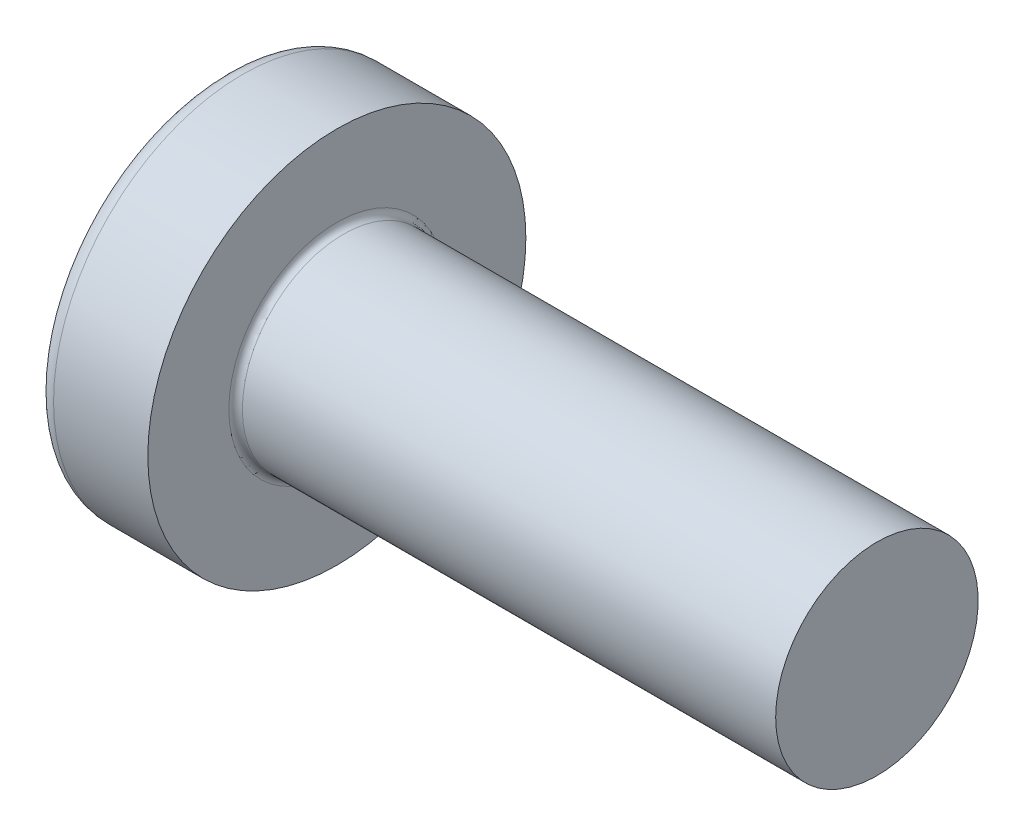
ISO-10303-21;
HEADER;
FILE_DESCRIPTION(('STEP AP214'),'2;1');
FILE_NAME('part.step','',(''),(''),'','','');
FILE_SCHEMA(('AUTOMOTIVE_DESIGN { 1 0 10303 214 1 1 1 1 }'));
ENDSEC;
DATA;
#1=APPLICATION_CONTEXT('core data for automotive mechanical design processes');
#2=APPLICATION_PROTOCOL_DEFINITION('international standard','automotive_design',2000,#1);
#3=PRODUCT_CONTEXT('',#1,'mechanical');
#4=PRODUCT('Part','Part','',(#3));
#5=PRODUCT_RELATED_PRODUCT_CATEGORY('part','',(#4));
#6=PRODUCT_DEFINITION_FORMATION('','',#4);
#7=PRODUCT_DEFINITION_CONTEXT('part definition',#1,'design');
#8=PRODUCT_DEFINITION('design','',#6,#7);
#9=PRODUCT_DEFINITION_SHAPE('','',#8);
#10=(LENGTH_UNIT() NAMED_UNIT(*) SI_UNIT(.MILLI.,.METRE.));
#11=(NAMED_UNIT(*) PLANE_ANGLE_UNIT() SI_UNIT($,.RADIAN.));
#12=(NAMED_UNIT(*) SI_UNIT($,.STERADIAN.) SOLID_ANGLE_UNIT());
#13=UNCERTAINTY_MEASURE_WITH_UNIT(LENGTH_MEASURE(1.E-05),#10,'distance_accuracy_value','');
#14=(GEOMETRIC_REPRESENTATION_CONTEXT(3) GLOBAL_UNCERTAINTY_ASSIGNED_CONTEXT((#13)) GLOBAL_UNIT_ASSIGNED_CONTEXT((#10,
#11,#12)) REPRESENTATION_CONTEXT('',''));
#15=CARTESIAN_POINT('',(0.,0.,0.));
#16=DIRECTION('',(0.,0.,1.));
#17=DIRECTION('',(1.,0.,0.));
#18=AXIS2_PLACEMENT_3D('',#15,#16,#17);
#19=CARTESIAN_POINT('',(5.,0.,0.));
#20=DIRECTION('',(-1.,0.,0.));
#21=DIRECTION('',(0.,1.,0.));
#22=AXIS2_PLACEMENT_3D('',#19,#20,#21);
#23=SPHERICAL_SURFACE('',#22,5.);
#24=CARTESIAN_POINT('',(0.775371598933733,0.,0.));
#25=DIRECTION('',(-1.,0.,0.));
#26=DIRECTION('',(0.,0.,1.));
#27=AXIS2_PLACEMENT_3D('',#24,#25,#26);
#28=CIRCLE('',#27,2.67441860465116);
#29=CARTESIAN_POINT('',(0.775371598933733,0.,2.67441860465116));
#30=VERTEX_POINT('',#29);
#31=EDGE_CURVE('E238',#30,#30,#28,.T.);
#32=ORIENTED_EDGE('',*,*,#31,.T.);
#33=EDGE_LOOP('',(#32));
#34=FACE_BOUND('',#33,.T.);
#35=CARTESIAN_POINT('',(0.0457951200896417,0.,0.));
#36=DIRECTION('',(1.,0.,0.));
#37=DIRECTION('',(0.,0.,-1.));
#38=AXIS2_PLACEMENT_3D('',#35,#36,#37);
#39=CIRCLE('',#38,0.675169614150692);
#40=CARTESIAN_POINT('',(0.0457951200896426,-0.369999999999998,-0.564760133040918));
#41=VERTEX_POINT('',#40);
#42=CARTESIAN_POINT('',(0.0457951200896417,-0.564760133040916,-0.37));
#43=VERTEX_POINT('',#42);
#44=EDGE_CURVE('E376',#41,#43,#39,.F.);
#45=ORIENTED_EDGE('',*,*,#44,.F.);
#46=CARTESIAN_POINT('',(5.,-0.37,0.));
#47=DIRECTION('',(0.,1.,0.));
#48=DIRECTION('',(0.,0.,1.));
#49=AXIS2_PLACEMENT_3D('',#46,#47,#48);
#50=CIRCLE('',#49,4.98629120689917);
#51=CARTESIAN_POINT('',(0.187869731256034,-0.369999999999995,-1.30633161051784));
#52=VERTEX_POINT('',#51);
#53=EDGE_CURVE('E302',#52,#41,#50,.T.);
#54=ORIENTED_EDGE('',*,*,#53,.F.);
#55=CARTESIAN_POINT('',(4.56358245832426,0.,0.875318202045668));
#56=DIRECTION('',(0.446197800778958,0.,-0.89493436774996));
#57=DIRECTION('',(-0.89493436774996,0.,-0.446197800778958));
#58=AXIS2_PLACEMENT_3D('',#55,#56,#57);
#59=CIRCLE('',#58,4.90340267309195);
#60=CARTESIAN_POINT('',(0.187869731256035,0.370000000000005,-1.30633161051784));
#61=VERTEX_POINT('',#60);
#62=EDGE_CURVE('E274',#52,#61,#59,.T.);
#63=ORIENTED_EDGE('',*,*,#62,.T.);
#64=CARTESIAN_POINT('',(5.,0.37,0.));
#65=DIRECTION('',(0.,-1.,0.));
#66=DIRECTION('',(0.,0.,-1.));
#67=AXIS2_PLACEMENT_3D('',#64,#65,#66);
#68=CIRCLE('',#67,4.98629120689917);
#69=CARTESIAN_POINT('',(0.0457951200896421,0.370000000000002,-0.564760133040916));
#70=VERTEX_POINT('',#69);
#71=EDGE_CURVE('E329',#70,#61,#68,.T.);
#72=ORIENTED_EDGE('',*,*,#71,.F.);
#73=CARTESIAN_POINT('',(0.0457951200896417,0.564760133040915,-0.37));
#74=VERTEX_POINT('',#73);
#75=EDGE_CURVE('E395',#74,#70,#39,.F.);
#76=ORIENTED_EDGE('',*,*,#75,.F.);
#77=CARTESIAN_POINT('',(5.,0.,-0.37));
#78=DIRECTION('',(0.,0.,1.));
#79=DIRECTION('',(1.,0.,0.));
#80=AXIS2_PLACEMENT_3D('',#77,#78,#79);
#81=CIRCLE('',#80,4.98629120689917);
#82=CARTESIAN_POINT('',(0.187869731256034,1.30633161051784,-0.37));
#83=VERTEX_POINT('',#82);
#84=EDGE_CURVE('E268',#83,#74,#81,.T.);
#85=ORIENTED_EDGE('',*,*,#84,.F.);
#86=CARTESIAN_POINT('',(4.56358245832426,-0.875318202045668,0.));
#87=DIRECTION('',(0.446197800778958,0.894934367749961,0.));
#88=DIRECTION('',(-0.89493436774996,0.446197800778958,0.));
#89=AXIS2_PLACEMENT_3D('',#86,#87,#88);
#90=CIRCLE('',#89,4.90340267309195);
#91=CARTESIAN_POINT('',(0.187869731256034,1.30633161051784,0.37));
#92=VERTEX_POINT('',#91);
#93=EDGE_CURVE('E271',#83,#92,#90,.T.);
#94=ORIENTED_EDGE('',*,*,#93,.T.);
#95=CARTESIAN_POINT('',(5.,0.,0.37));
#96=DIRECTION('',(0.,0.,-1.));
#97=DIRECTION('',(0.,1.,0.));
#98=AXIS2_PLACEMENT_3D('',#95,#96,#97);
#99=CIRCLE('',#98,4.98629120689917);
#100=CARTESIAN_POINT('',(0.0457951200896417,0.564760133040915,0.37));
#101=VERTEX_POINT('',#100);
#102=EDGE_CURVE('E264',#101,#92,#99,.T.);
#103=ORIENTED_EDGE('',*,*,#102,.F.);
#104=CARTESIAN_POINT('',(0.0457951200896426,0.369999999999998,0.564760133040918));
#105=VERTEX_POINT('',#104);
#106=EDGE_CURVE('E394',#105,#101,#39,.F.);
#107=ORIENTED_EDGE('',*,*,#106,.F.);
#108=CARTESIAN_POINT('',(0.187869731256033,0.369999999999995,1.30633161051784));
#109=VERTEX_POINT('',#108);
#110=EDGE_CURVE('E284',#109,#105,#68,.T.);
#111=ORIENTED_EDGE('',*,*,#110,.F.);
#112=CARTESIAN_POINT('',(4.56358245832426,0.,-0.875318202045669));
#113=DIRECTION('',(0.446197800778958,0.,0.894934367749961));
#114=DIRECTION('',(0.89493436774996,0.,-0.446197800778958));
#115=AXIS2_PLACEMENT_3D('',#112,#113,#114);
#116=CIRCLE('',#115,4.90340267309195);
#117=CARTESIAN_POINT('',(0.187869731256034,-0.370000000000005,1.30633161051784));
#118=VERTEX_POINT('',#117);
#119=EDGE_CURVE('E49',#109,#118,#116,.T.);
#120=ORIENTED_EDGE('',*,*,#119,.T.);
#121=CARTESIAN_POINT('',(0.0457951200896421,-0.370000000000002,0.564760133040916));
#122=VERTEX_POINT('',#121);
#123=EDGE_CURVE('E281',#122,#118,#50,.T.);
#124=ORIENTED_EDGE('',*,*,#123,.F.);
#125=CARTESIAN_POINT('',(0.0457951200896417,-0.564760133040916,0.37));
#126=VERTEX_POINT('',#125);
#127=EDGE_CURVE('E430',#126,#122,#39,.F.);
#128=ORIENTED_EDGE('',*,*,#127,.F.);
#129=CARTESIAN_POINT('',(0.187869731256033,-1.30633161051784,0.37));
#130=VERTEX_POINT('',#129);
#131=EDGE_CURVE('E265',#130,#126,#99,.T.);
#132=ORIENTED_EDGE('',*,*,#131,.F.);
#133=CARTESIAN_POINT('',(4.56358245832426,0.875318202045668,0.));
#134=DIRECTION('',(0.446197800778958,-0.89493436774996,0.));
#135=DIRECTION('',(0.89493436774996,0.446197800778958,0.));
#136=AXIS2_PLACEMENT_3D('',#133,#134,#135);
#137=CIRCLE('',#136,4.90340267309195);
#138=CARTESIAN_POINT('',(0.187869731256033,-1.30633161051784,-0.37));
#139=VERTEX_POINT('',#138);
#140=EDGE_CURVE('E261',#130,#139,#137,.T.);
#141=ORIENTED_EDGE('',*,*,#140,.T.);
#142=EDGE_CURVE('E64',#43,#139,#81,.T.);
#143=ORIENTED_EDGE('',*,*,#142,.F.);
#144=EDGE_LOOP('',(#45,#54,#63,#72,#76,#85,#94,#103,#107,#111,#120,#124,#128,#132,#141,#143));
#145=FACE_BOUND('',#144,.T.);
#146=ADVANCED_FACE('F36',(#34,#145),#23,.T.);
#147=CARTESIAN_POINT('',(1.75,0.527482216012805,-0.37));
#148=DIRECTION('',(0.,0.,1.));
#149=DIRECTION('',(1.,0.,0.));
#150=AXIS2_PLACEMENT_3D('',#147,#148,#149);
#151=PLANE('',#150);
#152=ORIENTED_EDGE('',*,*,#84,.T.);
#153=CARTESIAN_POINT('',(-0.987293237053716,0.649401255967161,-0.37));
#154=CARTESIAN_POINT('',(-0.781914975317084,0.632865887002871,-0.37));
#155=CARTESIAN_POINT('',(-0.576547882393372,0.616188977635081,-0.37));
#156=CARTESIAN_POINT('',(-0.165841599226327,0.582441031964227,-0.37));
#157=CARTESIAN_POINT('',(0.0394975903090452,0.56536998705488,-0.37));
#158=CARTESIAN_POINT('',(0.450133475422572,0.530723441326535,-0.37));
#159=CARTESIAN_POINT('',(0.655430171010573,0.513147940624557,-0.37));
#160=CARTESIAN_POINT('',(1.06596140177934,0.477314957985794,-0.37));
#161=CARTESIAN_POINT('',(1.2711959378071,0.459057485806066,-0.37));
#162=CARTESIAN_POINT('',(1.61065292365626,0.428051938688768,-0.37));
#163=CARTESIAN_POINT('',(1.74490059995643,0.415580824990931,-0.37));
#164=CARTESIAN_POINT('',(2.01334321762763,0.390092023404979,-0.37));
#165=CARTESIAN_POINT('',(2.14753815934577,0.377074339177353,-0.37));
#166=CARTESIAN_POINT('',(2.41586354151957,0.350315629452843,-0.37));
#167=CARTESIAN_POINT('',(2.5499939784531,0.33657456817765,-0.37));
#168=CARTESIAN_POINT('',(2.81814173295471,0.308004077741875,-0.37));
#169=CARTESIAN_POINT('',(2.95215904765134,0.293174621747065,-0.37));
#170=CARTESIAN_POINT('',(3.0860955068368,0.277618485071816,-0.37));
#171=B_SPLINE_CURVE_WITH_KNOTS('',3,(#153,#154,#155,#156,#157,#158,#159,#160,#161,#162,#163,
#164,#165,#166,#167,#168,#169,#170),.UNSPECIFIED.,.F.,.F.,(4,2,2,2,2,2,2,2,4),(0.,
0.618128793984691,1.23627109812525,1.85441325887562,2.4725465791681,2.87702276218609,
3.28149623678161,3.68598973550942,4.09049321032311),.UNSPECIFIED.);
#172=CARTESIAN_POINT('',(1.75,0.415013252800437,-0.370000000000001));
#173=VERTEX_POINT('',#172);
#174=EDGE_CURVE('E416',#74,#173,#171,.T.);
#175=ORIENTED_EDGE('',*,*,#174,.T.);
#176=DIRECTION('',(0.,1.,0.));
#177=VECTOR('',#176,1.);
#178=CARTESIAN_POINT('',(1.75,-0.527482216012805,-0.37));
#179=LINE('',#178,#177);
#180=CARTESIAN_POINT('',(1.75,0.527482216012805,-0.37));
#181=VERTEX_POINT('',#180);
#182=EDGE_CURVE('E358',#173,#181,#179,.T.);
#183=ORIENTED_EDGE('',*,*,#182,.T.);
#184=DIRECTION('',(0.89493436774996,-0.446197800778958,0.));
#185=VECTOR('',#184,1.);
#186=CARTESIAN_POINT('',(0.,1.4,-0.37));
#187=LINE('',#186,#185);
#188=EDGE_CURVE('E239',#83,#181,#187,.T.);
#189=ORIENTED_EDGE('',*,*,#188,.F.);
#190=EDGE_LOOP('',(#152,#175,#183,#189));
#191=FACE_BOUND('',#190,.T.);
#192=ADVANCED_FACE('F194',(#191),#151,.T.);
#193=CARTESIAN_POINT('',(1.75,-0.527482216012805,-0.37));
#194=VERTEX_POINT('',#193);
#195=CARTESIAN_POINT('',(1.75,-0.415013252800437,-0.370000000000001));
#196=VERTEX_POINT('',#195);
#197=EDGE_CURVE('E247',#194,#196,#179,.T.);
#198=ORIENTED_EDGE('',*,*,#197,.T.);
#199=CARTESIAN_POINT('',(-0.987293237053716,-0.649401255967161,-0.37));
#200=CARTESIAN_POINT('',(-0.781914975317084,-0.632865887002871,-0.37));
#201=CARTESIAN_POINT('',(-0.576547882393372,-0.616188977635081,-0.37));
#202=CARTESIAN_POINT('',(-0.165841599226327,-0.582441031964227,-0.37));
#203=CARTESIAN_POINT('',(0.0394975903090452,-0.56536998705488,-0.37));
#204=CARTESIAN_POINT('',(0.450133475422572,-0.530723441326535,-0.37));
#205=CARTESIAN_POINT('',(0.655430171010573,-0.513147940624557,-0.37));
#206=CARTESIAN_POINT('',(1.06596140177934,-0.477314957985794,-0.37));
#207=CARTESIAN_POINT('',(1.2711959378071,-0.459057485806066,-0.37));
#208=CARTESIAN_POINT('',(1.61065292365626,-0.428051938688768,-0.37));
#209=CARTESIAN_POINT('',(1.74490059995643,-0.415580824990931,-0.37));
#210=CARTESIAN_POINT('',(2.01334321762763,-0.390092023404979,-0.37));
#211=CARTESIAN_POINT('',(2.14753815934577,-0.377074339177353,-0.37));
#212=CARTESIAN_POINT('',(2.41586354151957,-0.350315629452843,-0.37));
#213=CARTESIAN_POINT('',(2.5499939784531,-0.33657456817765,-0.37));
#214=CARTESIAN_POINT('',(2.81814173295471,-0.308004077741875,-0.37));
#215=CARTESIAN_POINT('',(2.95215904765134,-0.293174621747065,-0.37));
#216=CARTESIAN_POINT('',(3.0860955068368,-0.277618485071816,-0.37));
#217=B_SPLINE_CURVE_WITH_KNOTS('',3,(#199,#200,#201,#202,#203,#204,#205,#206,#207,#208,#209,
#210,#211,#212,#213,#214,#215,#216),.UNSPECIFIED.,.F.,.F.,(4,2,2,2,2,2,2,2,4),(0.,
0.618128793984691,1.23627109812525,1.85441325887562,2.4725465791681,2.87702276218609,
3.28149623678161,3.68598973550942,4.09049321032311),.UNSPECIFIED.);
#218=EDGE_CURVE('E393',#196,#43,#217,.F.);
#219=ORIENTED_EDGE('',*,*,#218,.T.);
#220=ORIENTED_EDGE('',*,*,#142,.T.);
#221=DIRECTION('',(0.89493436774996,0.446197800778958,0.));
#222=VECTOR('',#221,1.);
#223=CARTESIAN_POINT('',(0.,-1.4,-0.37));
#224=LINE('',#223,#222);
#225=EDGE_CURVE('E332',#139,#194,#224,.T.);
#226=ORIENTED_EDGE('',*,*,#225,.T.);
#227=EDGE_LOOP('',(#198,#219,#220,#226));
#228=FACE_BOUND('',#227,.T.);
#229=ADVANCED_FACE('F200',(#228),#151,.T.);
#230=CARTESIAN_POINT('',(1.75,-0.527482216012805,0.37));
#231=DIRECTION('',(0.,0.,-1.));
#232=DIRECTION('',(0.,1.,0.));
#233=AXIS2_PLACEMENT_3D('',#230,#231,#232);
#234=PLANE('',#233);
#235=DIRECTION('',(0.,-1.,0.));
#236=VECTOR('',#235,1.);
#237=CARTESIAN_POINT('',(1.75,0.527482216012805,0.37));
#238=LINE('',#237,#236);
#239=CARTESIAN_POINT('',(1.75,0.527482216012805,0.37));
#240=VERTEX_POINT('',#239);
#241=CARTESIAN_POINT('',(1.75,0.415013252800437,0.370000000000001));
#242=VERTEX_POINT('',#241);
#243=EDGE_CURVE('E341',#240,#242,#238,.T.);
#244=ORIENTED_EDGE('',*,*,#243,.T.);
#245=CARTESIAN_POINT('',(-0.987293237053716,0.649401255967161,0.37));
#246=CARTESIAN_POINT('',(-0.781914975317084,0.632865887002871,0.37));
#247=CARTESIAN_POINT('',(-0.576547882393372,0.616188977635081,0.37));
#248=CARTESIAN_POINT('',(-0.165841599226327,0.582441031964227,0.37));
#249=CARTESIAN_POINT('',(0.0394975903090453,0.56536998705488,0.37));
#250=CARTESIAN_POINT('',(0.450133475422572,0.530723441326535,0.37));
#251=CARTESIAN_POINT('',(0.655430171010574,0.513147940624557,0.37));
#252=CARTESIAN_POINT('',(1.06596140177934,0.477314957985794,0.37));
#253=CARTESIAN_POINT('',(1.2711959378071,0.459057485806066,0.37));
#254=CARTESIAN_POINT('',(1.61065292365626,0.428051938688768,0.37));
#255=CARTESIAN_POINT('',(1.74490059995643,0.415580824990931,0.37));
#256=CARTESIAN_POINT('',(2.01334321762763,0.39009202340498,0.37));
#257=CARTESIAN_POINT('',(2.14753815934577,0.377074339177353,0.37));
#258=CARTESIAN_POINT('',(2.41586354151957,0.350315629452843,0.37));
#259=CARTESIAN_POINT('',(2.5499939784531,0.33657456817765,0.37));
#260=CARTESIAN_POINT('',(2.81814173295471,0.308004077741875,0.37));
#261=CARTESIAN_POINT('',(2.95215904765134,0.293174621747065,0.37));
#262=CARTESIAN_POINT('',(3.0860955068368,0.277618485071816,0.37));
#263=B_SPLINE_CURVE_WITH_KNOTS('',3,(#245,#246,#247,#248,#249,#250,#251,#252,#253,#254,#255,
#256,#257,#258,#259,#260,#261,#262),.UNSPECIFIED.,.F.,.F.,(4,2,2,2,2,2,2,2,4),(0.,
0.618128793984691,1.23627109812525,1.85441325887562,2.4725465791681,2.87702276218609,
3.28149623678161,3.68598973550942,4.09049321032311),.UNSPECIFIED.);
#264=EDGE_CURVE('E692',#242,#101,#263,.F.);
#265=ORIENTED_EDGE('',*,*,#264,.T.);
#266=ORIENTED_EDGE('',*,*,#102,.T.);
#267=DIRECTION('',(0.89493436774996,-0.446197800778958,0.));
#268=VECTOR('',#267,1.);
#269=CARTESIAN_POINT('',(0.,1.4,0.37));
#270=LINE('',#269,#268);
#271=EDGE_CURVE('E244',#92,#240,#270,.T.);
#272=ORIENTED_EDGE('',*,*,#271,.T.);
#273=EDGE_LOOP('',(#244,#265,#266,#272));
#274=FACE_BOUND('',#273,.T.);
#275=ADVANCED_FACE('F412',(#274),#234,.T.);
#276=ORIENTED_EDGE('',*,*,#131,.T.);
#277=CARTESIAN_POINT('',(-0.987293237069635,-0.649401255968442,0.37));
#278=CARTESIAN_POINT('',(-0.781914975331301,-0.632865887004023,0.37));
#279=CARTESIAN_POINT('',(-0.576547882405888,-0.616188977636102,0.37));
#280=CARTESIAN_POINT('',(-0.16584159923544,-0.582441031964983,0.37));
#281=CARTESIAN_POINT('',(0.0394975903016338,-0.5653699870555,0.37));
#282=CARTESIAN_POINT('',(0.450133475420601,-0.530723441326706,0.37));
#283=CARTESIAN_POINT('',(0.655430171012341,-0.513147940624409,0.37));
#284=CARTESIAN_POINT('',(1.06596140178858,-0.477314957984981,0.37));
#285=CARTESIAN_POINT('',(1.27119593782008,-0.459057485804908,0.37));
#286=CARTESIAN_POINT('',(1.61065292367297,-0.428051938687225,0.37));
#287=CARTESIAN_POINT('',(1.74490059997313,-0.415580824989368,0.37));
#288=CARTESIAN_POINT('',(2.01334321764434,-0.390092023403371,0.37));
#289=CARTESIAN_POINT('',(2.14753815936247,-0.377074339175718,0.37));
#290=CARTESIAN_POINT('',(2.41586354153627,-0.350315629451146,0.37));
#291=CARTESIAN_POINT('',(2.54999397846979,-0.336574568175918,0.37));
#292=CARTESIAN_POINT('',(2.8181417329714,-0.308004077740054,0.37));
#293=CARTESIAN_POINT('',(2.95215904766802,-0.29317462174519,0.37));
#294=CARTESIAN_POINT('',(3.08609550685347,-0.277618485069873,0.37));
#295=B_SPLINE_CURVE_WITH_KNOTS('',3,(#277,#278,#279,#280,#281,#282,#283,#284,#285,#286,#287,
#288,#289,#290,#291,#292,#293,#294),.UNSPECIFIED.,.F.,.F.,(4,2,2,2,2,2,2,2,4),(0.,
0.61812879398981,1.23627109813549,1.85441325889711,2.47254657920086,2.87702276221884,
3.28149623681437,3.68598973554218,4.09049321035586),.UNSPECIFIED.);
#296=CARTESIAN_POINT('',(1.75,-0.415013252800437,0.37));
#297=VERTEX_POINT('',#296);
#298=EDGE_CURVE('E431',#126,#297,#295,.T.);
#299=ORIENTED_EDGE('',*,*,#298,.T.);
#300=CARTESIAN_POINT('',(1.75,-0.527482216012805,0.37));
#301=VERTEX_POINT('',#300);
#302=EDGE_CURVE('E343',#297,#301,#238,.T.);
#303=ORIENTED_EDGE('',*,*,#302,.T.);
#304=DIRECTION('',(0.89493436774996,0.446197800778958,0.));
#305=VECTOR('',#304,1.);
#306=CARTESIAN_POINT('',(0.,-1.4,0.37));
#307=LINE('',#306,#305);
#308=EDGE_CURVE('E334',#130,#301,#307,.T.);
#309=ORIENTED_EDGE('',*,*,#308,.F.);
#310=EDGE_LOOP('',(#276,#299,#303,#309));
#311=FACE_BOUND('',#310,.T.);
#312=ADVANCED_FACE('F522',(#311),#234,.T.);
#313=CARTESIAN_POINT('',(1.75,0.527482216012805,0.37));
#314=DIRECTION('',(0.446197800778958,0.894934367749961,0.));
#315=DIRECTION('',(-0.89493436774996,0.446197800778958,0.));
#316=AXIS2_PLACEMENT_3D('',#313,#314,#315);
#317=PLANE('',#316);
#318=CARTESIAN_POINT('',(2.66965234556629,0.0689604865315897,0.));
#319=DIRECTION('',(0.446197800778958,0.894934367749961,0.));
#320=DIRECTION('',(-0.89493436774996,0.446197800778958,0.));
#321=AXIS2_PLACEMENT_3D('',#318,#319,#320);
#322=ELLIPSE('',#321,1.10195891266117,0.486831719863514);
#323=CARTESIAN_POINT('',(1.75,0.527482216012806,0.175779725196677));
#324=VERTEX_POINT('',#323);
#325=CARTESIAN_POINT('',(1.75,0.527482216012806,-0.175779725196677));
#326=VERTEX_POINT('',#325);
#327=EDGE_CURVE('E307',#324,#326,#322,.F.);
#328=ORIENTED_EDGE('',*,*,#327,.F.);
#329=DIRECTION('',(0.,0.,-1.));
#330=VECTOR('',#329,1.);
#331=CARTESIAN_POINT('',(1.75,0.527482216012805,0.37));
#332=LINE('',#331,#330);
#333=EDGE_CURVE('E344',#240,#324,#332,.T.);
#334=ORIENTED_EDGE('',*,*,#333,.F.);
#335=ORIENTED_EDGE('',*,*,#271,.F.);
#336=ORIENTED_EDGE('',*,*,#93,.F.);
#337=ORIENTED_EDGE('',*,*,#188,.T.);
#338=EDGE_CURVE('E346',#326,#181,#332,.T.);
#339=ORIENTED_EDGE('',*,*,#338,.F.);
#340=EDGE_LOOP('',(#328,#334,#335,#336,#337,#339));
#341=FACE_BOUND('',#340,.T.);
#342=ADVANCED_FACE('F410',(#341),#317,.F.);
#343=CARTESIAN_POINT('',(1.75,-0.527482216012805,-0.37));
#344=DIRECTION('',(0.446197800778958,-0.89493436774996,0.));
#345=DIRECTION('',(0.89493436774996,0.446197800778958,0.));
#346=AXIS2_PLACEMENT_3D('',#343,#344,#345);
#347=PLANE('',#346);
#348=CARTESIAN_POINT('',(2.66965234556629,-0.06896048653159,0.));
#349=DIRECTION('',(0.446197800778958,-0.89493436774996,0.));
#350=DIRECTION('',(-0.89493436774996,-0.446197800778958,0.));
#351=AXIS2_PLACEMENT_3D('',#348,#349,#350);
#352=ELLIPSE('',#351,1.10195891266117,0.486831719863513);
#353=CARTESIAN_POINT('',(1.75,-0.527482216012806,-0.175779725196678));
#354=VERTEX_POINT('',#353);
#355=CARTESIAN_POINT('',(1.75,-0.527482216012806,0.175779725196678));
#356=VERTEX_POINT('',#355);
#357=EDGE_CURVE('E694',#354,#356,#352,.F.);
#358=ORIENTED_EDGE('',*,*,#357,.F.);
#359=DIRECTION('',(0.,0.,1.));
#360=VECTOR('',#359,1.);
#361=CARTESIAN_POINT('',(1.75,-0.527482216012805,-0.37));
#362=LINE('',#361,#360);
#363=EDGE_CURVE('E337',#194,#354,#362,.T.);
#364=ORIENTED_EDGE('',*,*,#363,.F.);
#365=ORIENTED_EDGE('',*,*,#225,.F.);
#366=ORIENTED_EDGE('',*,*,#140,.F.);
#367=ORIENTED_EDGE('',*,*,#308,.T.);
#368=EDGE_CURVE('E340',#356,#301,#362,.T.);
#369=ORIENTED_EDGE('',*,*,#368,.F.);
#370=EDGE_LOOP('',(#358,#364,#365,#366,#367,#369));
#371=FACE_BOUND('',#370,.T.);
#372=ADVANCED_FACE('F509',(#371),#347,.F.);
#373=CARTESIAN_POINT('',(1.75,0.527482216012805,-0.37));
#374=DIRECTION('',(-1.,0.,0.));
#375=DIRECTION('',(0.,0.,1.));
#376=AXIS2_PLACEMENT_3D('',#373,#374,#375);
#377=PLANE('',#376);
#378=DIRECTION('',(0.,1.,0.));
#379=VECTOR('',#378,1.);
#380=CARTESIAN_POINT('',(1.75,-0.370000000000002,0.527482216012804));
#381=LINE('',#380,#379);
#382=CARTESIAN_POINT('',(1.75,-0.370000000000002,0.527482216012804));
#383=VERTEX_POINT('',#382);
#384=CARTESIAN_POINT('',(1.75,-0.175779725196681,0.527482216012805));
#385=VERTEX_POINT('',#384);
#386=EDGE_CURVE('E322',#383,#385,#381,.T.);
#387=ORIENTED_EDGE('',*,*,#386,.T.);
#388=CARTESIAN_POINT('',(1.75,0.,0.));
#389=DIRECTION('',(-1.,0.,0.));
#390=DIRECTION('',(0.,0.,1.));
#391=AXIS2_PLACEMENT_3D('',#388,#389,#390);
#392=CIRCLE('',#391,0.556);
#393=CARTESIAN_POINT('',(1.75,-0.370000000000001,0.415013252800436));
#394=VERTEX_POINT('',#393);
#395=EDGE_CURVE('E720',#394,#385,#392,.T.);
#396=ORIENTED_EDGE('',*,*,#395,.F.);
#397=DIRECTION('',(0.,0.,-1.));
#398=VECTOR('',#397,1.);
#399=CARTESIAN_POINT('',(1.75,-0.370000000000002,0.527482216012804));
#400=LINE('',#399,#398);
#401=EDGE_CURVE('E318',#383,#394,#400,.T.);
#402=ORIENTED_EDGE('',*,*,#401,.F.);
#403=EDGE_LOOP('',(#387,#396,#402));
#404=FACE_BOUND('',#403,.T.);
#405=ADVANCED_FACE('F466',(#404),#377,.T.);
#406=ORIENTED_EDGE('',*,*,#302,.F.);
#407=EDGE_CURVE('E725',#356,#297,#392,.T.);
#408=ORIENTED_EDGE('',*,*,#407,.F.);
#409=ORIENTED_EDGE('',*,*,#368,.T.);
#410=EDGE_LOOP('',(#406,#408,#409));
#411=FACE_BOUND('',#410,.T.);
#412=ADVANCED_FACE('F496',(#411),#377,.T.);
#413=ORIENTED_EDGE('',*,*,#363,.T.);
#414=EDGE_CURVE('E387',#196,#354,#392,.T.);
#415=ORIENTED_EDGE('',*,*,#414,.F.);
#416=ORIENTED_EDGE('',*,*,#197,.F.);
#417=EDGE_LOOP('',(#413,#415,#416));
#418=FACE_BOUND('',#417,.T.);
#419=ADVANCED_FACE('F490',(#418),#377,.T.);
#420=CARTESIAN_POINT('',(1.75,-0.369999999999998,-0.415013252800438));
#421=VERTEX_POINT('',#420);
#422=CARTESIAN_POINT('',(1.75,-0.369999999999998,-0.527482216012807));
#423=VERTEX_POINT('',#422);
#424=EDGE_CURVE('E321',#421,#423,#400,.T.);
#425=ORIENTED_EDGE('',*,*,#424,.F.);
#426=CARTESIAN_POINT('',(1.75,-0.175779725196678,-0.527482216012806));
#427=VERTEX_POINT('',#426);
#428=EDGE_CURVE('E56',#427,#421,#392,.T.);
#429=ORIENTED_EDGE('',*,*,#428,.F.);
#430=DIRECTION('',(0.,-1.,0.));
#431=VECTOR('',#430,1.);
#432=CARTESIAN_POINT('',(1.75,0.370000000000002,-0.527482216012804));
#433=LINE('',#432,#431);
#434=EDGE_CURVE('E317',#427,#423,#433,.T.);
#435=ORIENTED_EDGE('',*,*,#434,.T.);
#436=EDGE_LOOP('',(#425,#429,#435));
#437=FACE_BOUND('',#436,.T.);
#438=ADVANCED_FACE('F382',(#437),#377,.T.);
#439=CARTESIAN_POINT('',(1.75,0.370000000000002,-0.527482216012804));
#440=VERTEX_POINT('',#439);
#441=CARTESIAN_POINT('',(1.75,0.175779725196681,-0.527482216012805));
#442=VERTEX_POINT('',#441);
#443=EDGE_CURVE('E314',#440,#442,#433,.T.);
#444=ORIENTED_EDGE('',*,*,#443,.T.);
#445=CARTESIAN_POINT('',(1.75,0.370000000000001,-0.415013252800436));
#446=VERTEX_POINT('',#445);
#447=EDGE_CURVE('E386',#446,#442,#392,.T.);
#448=ORIENTED_EDGE('',*,*,#447,.F.);
#449=DIRECTION('',(0.,0.,1.));
#450=VECTOR('',#449,1.);
#451=CARTESIAN_POINT('',(1.75,0.370000000000002,-0.527482216012804));
#452=LINE('',#451,#450);
#453=EDGE_CURVE('E326',#440,#446,#452,.T.);
#454=ORIENTED_EDGE('',*,*,#453,.F.);
#455=EDGE_LOOP('',(#444,#448,#454));
#456=FACE_BOUND('',#455,.T.);
#457=ADVANCED_FACE('F478',(#456),#377,.T.);
#458=ORIENTED_EDGE('',*,*,#182,.F.);
#459=EDGE_CURVE('E709',#326,#173,#392,.T.);
#460=ORIENTED_EDGE('',*,*,#459,.F.);
#461=ORIENTED_EDGE('',*,*,#338,.T.);
#462=EDGE_LOOP('',(#458,#460,#461));
#463=FACE_BOUND('',#462,.T.);
#464=ADVANCED_FACE('F472',(#463),#377,.T.);
#465=ORIENTED_EDGE('',*,*,#333,.T.);
#466=EDGE_CURVE('E711',#242,#324,#392,.T.);
#467=ORIENTED_EDGE('',*,*,#466,.F.);
#468=ORIENTED_EDGE('',*,*,#243,.F.);
#469=EDGE_LOOP('',(#465,#467,#468));
#470=FACE_BOUND('',#469,.T.);
#471=ADVANCED_FACE('F464',(#470),#377,.T.);
#472=CARTESIAN_POINT('',(1.75,0.369999999999999,0.415013252800439));
#473=VERTEX_POINT('',#472);
#474=CARTESIAN_POINT('',(1.75,0.369999999999998,0.527482216012807));
#475=VERTEX_POINT('',#474);
#476=EDGE_CURVE('E299',#473,#475,#452,.T.);
#477=ORIENTED_EDGE('',*,*,#476,.F.);
#478=CARTESIAN_POINT('',(1.75,0.175779725196678,0.527482216012806));
#479=VERTEX_POINT('',#478);
#480=EDGE_CURVE('E388',#479,#473,#392,.T.);
#481=ORIENTED_EDGE('',*,*,#480,.F.);
#482=EDGE_CURVE('E325',#479,#475,#381,.T.);
#483=ORIENTED_EDGE('',*,*,#482,.T.);
#484=EDGE_LOOP('',(#477,#481,#483));
#485=FACE_BOUND('',#484,.T.);
#486=ADVANCED_FACE('F458',(#485),#377,.T.);
#487=CARTESIAN_POINT('',(1.75,0.369999999999998,0.527482216012806));
#488=DIRECTION('',(0.,-1.,0.));
#489=DIRECTION('',(1.,0.,0.));
#490=AXIS2_PLACEMENT_3D('',#487,#488,#489);
#491=PLANE('',#490);
#492=ORIENTED_EDGE('',*,*,#110,.T.);
#493=CARTESIAN_POINT('',(-0.987293237069635,0.369999999999998,0.649401255968443));
#494=CARTESIAN_POINT('',(-0.781914975331301,0.369999999999998,0.632865887004024));
#495=CARTESIAN_POINT('',(-0.576547882405888,0.369999999999998,0.616188977636103));
#496=CARTESIAN_POINT('',(-0.16584159923544,0.369999999999998,0.582441031964984));
#497=CARTESIAN_POINT('',(0.0394975903016338,0.369999999999998,0.565369987055501));
#498=CARTESIAN_POINT('',(0.450133475420601,0.369999999999998,0.530723441326707));
#499=CARTESIAN_POINT('',(0.655430171012341,0.369999999999998,0.51314794062441));
#500=CARTESIAN_POINT('',(1.06596140178858,0.369999999999998,0.477314957984982));
#501=CARTESIAN_POINT('',(1.27119593782008,0.369999999999998,0.459057485804909));
#502=CARTESIAN_POINT('',(1.61065292367297,0.369999999999999,0.428051938687226));
#503=CARTESIAN_POINT('',(1.74490059997313,0.369999999999999,0.415580824989369));
#504=CARTESIAN_POINT('',(2.01334321764434,0.369999999999999,0.390092023403372));
#505=CARTESIAN_POINT('',(2.14753815936247,0.369999999999999,0.37707433917572));
#506=CARTESIAN_POINT('',(2.41586354153627,0.369999999999999,0.350315629451147));
#507=CARTESIAN_POINT('',(2.54999397846979,0.369999999999999,0.336574568175919));
#508=CARTESIAN_POINT('',(2.8181417329714,0.369999999999999,0.308004077740055));
#509=CARTESIAN_POINT('',(2.95215904766802,0.369999999999999,0.293174621745191));
#510=CARTESIAN_POINT('',(3.08609550685347,0.369999999999999,0.277618485069875));
#511=B_SPLINE_CURVE_WITH_KNOTS('',3,(#493,#494,#495,#496,#497,#498,#499,#500,#501,#502,#503,
#504,#505,#506,#507,#508,#509,#510),.UNSPECIFIED.,.F.,.F.,(4,2,2,2,2,2,2,2,4),(0.,
0.61812879398981,1.23627109813549,1.85441325889711,2.47254657920086,2.87702276221884,
3.28149623681436,3.68598973554218,4.09049321035586),.UNSPECIFIED.);
#512=EDGE_CURVE('E691',#105,#473,#511,.T.);
#513=ORIENTED_EDGE('',*,*,#512,.T.);
#514=ORIENTED_EDGE('',*,*,#476,.T.);
#515=DIRECTION('',(0.89493436774996,0.,-0.446197800778958));
#516=VECTOR('',#515,1.);
#517=CARTESIAN_POINT('',(0.,0.369999999999995,1.4));
#518=LINE('',#517,#516);
#519=EDGE_CURVE('E292',#109,#475,#518,.T.);
#520=ORIENTED_EDGE('',*,*,#519,.F.);
#521=EDGE_LOOP('',(#492,#513,#514,#520));
#522=FACE_BOUND('',#521,.T.);
#523=ADVANCED_FACE('F296',(#522),#491,.T.);
#524=CARTESIAN_POINT('',(1.75,-0.369999999999998,-0.527482216012807));
#525=DIRECTION('',(0.,1.,0.));
#526=DIRECTION('',(0.,0.,1.));
#527=AXIS2_PLACEMENT_3D('',#524,#525,#526);
#528=PLANE('',#527);
#529=ORIENTED_EDGE('',*,*,#401,.T.);
#530=CARTESIAN_POINT('',(-0.987293237053716,-0.370000000000002,0.64940125596716));
#531=CARTESIAN_POINT('',(-0.781914975317084,-0.370000000000002,0.63286588700287));
#532=CARTESIAN_POINT('',(-0.576547882393372,-0.370000000000002,0.61618897763508));
#533=CARTESIAN_POINT('',(-0.165841599226327,-0.370000000000002,0.582441031964225));
#534=CARTESIAN_POINT('',(0.0394975903090451,-0.370000000000002,0.565369987054878));
#535=CARTESIAN_POINT('',(0.450133475422572,-0.370000000000002,0.530723441326533));
#536=CARTESIAN_POINT('',(0.655430171010573,-0.370000000000002,0.513147940624555));
#537=CARTESIAN_POINT('',(1.06596140177934,-0.370000000000002,0.477314957985793));
#538=CARTESIAN_POINT('',(1.2711959378071,-0.370000000000002,0.459057485806065));
#539=CARTESIAN_POINT('',(1.61065292365626,-0.370000000000001,0.428051938688767));
#540=CARTESIAN_POINT('',(1.74490059995642,-0.370000000000001,0.41558082499093));
#541=CARTESIAN_POINT('',(2.01334321762763,-0.370000000000001,0.390092023404978));
#542=CARTESIAN_POINT('',(2.14753815934577,-0.370000000000001,0.377074339177352));
#543=CARTESIAN_POINT('',(2.41586354151957,-0.370000000000001,0.350315629452841));
#544=CARTESIAN_POINT('',(2.5499939784531,-0.370000000000001,0.336574568177649));
#545=CARTESIAN_POINT('',(2.81814173295471,-0.370000000000001,0.308004077741874));
#546=CARTESIAN_POINT('',(2.95215904765134,-0.370000000000001,0.293174621747063));
#547=CARTESIAN_POINT('',(3.0860955068368,-0.370000000000001,0.277618485071814));
#548=B_SPLINE_CURVE_WITH_KNOTS('',3,(#530,#531,#532,#533,#534,#535,#536,#537,#538,#539,#540,
#541,#542,#543,#544,#545,#546,#547),.UNSPECIFIED.,.F.,.F.,(4,2,2,2,2,2,2,2,4),(0.,
0.618128793984691,1.23627109812525,1.85441325887562,2.4725465791681,2.87702276218609,
3.28149623678161,3.68598973550942,4.09049321032311),.UNSPECIFIED.);
#549=EDGE_CURVE('E424',#394,#122,#548,.F.);
#550=ORIENTED_EDGE('',*,*,#549,.T.);
#551=ORIENTED_EDGE('',*,*,#123,.T.);
#552=DIRECTION('',(0.89493436774996,0.,-0.446197800778958));
#553=VECTOR('',#552,1.);
#554=CARTESIAN_POINT('',(0.,-0.370000000000005,1.4));
#555=LINE('',#554,#553);
#556=EDGE_CURVE('E294',#118,#383,#555,.T.);
#557=ORIENTED_EDGE('',*,*,#556,.T.);
#558=EDGE_LOOP('',(#529,#550,#551,#557));
#559=FACE_BOUND('',#558,.T.);
#560=ADVANCED_FACE('F229',(#559),#528,.T.);
#561=CARTESIAN_POINT('',(1.75,-0.370000000000002,0.527482216012804));
#562=DIRECTION('',(0.446197800778958,0.,0.894934367749961));
#563=DIRECTION('',(-0.89493436774996,0.,0.446197800778958));
#564=AXIS2_PLACEMENT_3D('',#561,#562,#563);
#565=PLANE('',#564);
#566=CARTESIAN_POINT('',(2.66965234556629,0.,0.0689604865315897));
#567=DIRECTION('',(0.446197800778958,0.,0.894934367749961));
#568=DIRECTION('',(-0.89493436774996,0.,0.446197800778958));
#569=AXIS2_PLACEMENT_3D('',#566,#567,#568);
#570=ELLIPSE('',#569,1.10195891266117,0.486831719863514);
#571=EDGE_CURVE('E422',#385,#479,#570,.F.);
#572=ORIENTED_EDGE('',*,*,#571,.F.);
#573=ORIENTED_EDGE('',*,*,#386,.F.);
#574=ORIENTED_EDGE('',*,*,#556,.F.);
#575=ORIENTED_EDGE('',*,*,#119,.F.);
#576=ORIENTED_EDGE('',*,*,#519,.T.);
#577=ORIENTED_EDGE('',*,*,#482,.F.);
#578=EDGE_LOOP('',(#572,#573,#574,#575,#576,#577));
#579=FACE_BOUND('',#578,.T.);
#580=ADVANCED_FACE('F290',(#579),#565,.F.);
#581=CARTESIAN_POINT('',(1.75,0.370000000000002,-0.527482216012804));
#582=DIRECTION('',(0.446197800778958,0.,-0.89493436774996));
#583=DIRECTION('',(0.89493436774996,0.,0.446197800778958));
#584=AXIS2_PLACEMENT_3D('',#581,#582,#583);
#585=PLANE('',#584);
#586=CARTESIAN_POINT('',(2.66965234556629,0.,-0.0689604865315901));
#587=DIRECTION('',(0.446197800778958,0.,-0.89493436774996));
#588=DIRECTION('',(-0.89493436774996,0.,-0.446197800778958));
#589=AXIS2_PLACEMENT_3D('',#586,#587,#588);
#590=ELLIPSE('',#589,1.10195891266117,0.486831719863513);
#591=EDGE_CURVE('E380',#442,#427,#590,.F.);
#592=ORIENTED_EDGE('',*,*,#591,.F.);
#593=ORIENTED_EDGE('',*,*,#443,.F.);
#594=DIRECTION('',(0.89493436774996,0.,0.446197800778958));
#595=VECTOR('',#594,1.);
#596=CARTESIAN_POINT('',(0.,0.370000000000005,-1.4));
#597=LINE('',#596,#595);
#598=EDGE_CURVE('E304',#61,#440,#597,.T.);
#599=ORIENTED_EDGE('',*,*,#598,.F.);
#600=ORIENTED_EDGE('',*,*,#62,.F.);
#601=DIRECTION('',(0.89493436774996,0.,0.446197800778958));
#602=VECTOR('',#601,1.);
#603=CARTESIAN_POINT('',(0.,-0.369999999999995,-1.4));
#604=LINE('',#603,#602);
#605=EDGE_CURVE('E311',#52,#423,#604,.T.);
#606=ORIENTED_EDGE('',*,*,#605,.T.);
#607=ORIENTED_EDGE('',*,*,#434,.F.);
#608=EDGE_LOOP('',(#592,#593,#599,#600,#606,#607));
#609=FACE_BOUND('',#608,.T.);
#610=ADVANCED_FACE('F371',(#609),#585,.F.);
#611=ORIENTED_EDGE('',*,*,#453,.T.);
#612=CARTESIAN_POINT('',(-0.987293237053716,0.370000000000002,-0.649401255967159));
#613=CARTESIAN_POINT('',(-0.781914975317084,0.370000000000002,-0.63286588700287));
#614=CARTESIAN_POINT('',(-0.576547882393372,0.370000000000002,-0.61618897763508));
#615=CARTESIAN_POINT('',(-0.165841599226327,0.370000000000002,-0.582441031964225));
#616=CARTESIAN_POINT('',(0.039497590309045,0.370000000000002,-0.565369987054878));
#617=CARTESIAN_POINT('',(0.450133475422572,0.370000000000002,-0.530723441326533));
#618=CARTESIAN_POINT('',(0.655430171010573,0.370000000000002,-0.513147940624555));
#619=CARTESIAN_POINT('',(1.06596140177934,0.370000000000002,-0.477314957985793));
#620=CARTESIAN_POINT('',(1.2711959378071,0.370000000000002,-0.459057485806065));
#621=CARTESIAN_POINT('',(1.61065292365626,0.370000000000001,-0.428051938688767));
#622=CARTESIAN_POINT('',(1.74490059995642,0.370000000000001,-0.41558082499093));
#623=CARTESIAN_POINT('',(2.01334321762763,0.370000000000001,-0.390092023404978));
#624=CARTESIAN_POINT('',(2.14753815934577,0.370000000000001,-0.377074339177352));
#625=CARTESIAN_POINT('',(2.41586354151957,0.370000000000001,-0.350315629452841));
#626=CARTESIAN_POINT('',(2.5499939784531,0.370000000000001,-0.336574568177649));
#627=CARTESIAN_POINT('',(2.81814173295471,0.370000000000001,-0.308004077741874));
#628=CARTESIAN_POINT('',(2.95215904765134,0.370000000000001,-0.293174621747064));
#629=CARTESIAN_POINT('',(3.0860955068368,0.370000000000001,-0.277618485071814));
#630=B_SPLINE_CURVE_WITH_KNOTS('',3,(#612,#613,#614,#615,#616,#617,#618,#619,#620,#621,#622,
#623,#624,#625,#626,#627,#628,#629),.UNSPECIFIED.,.F.,.F.,(4,2,2,2,2,2,2,2,4),(0.,
0.618128793984691,1.23627109812525,1.85441325887562,2.4725465791681,2.87702276218609,
3.28149623678161,3.68598973550942,4.09049321032311),.UNSPECIFIED.);
#631=EDGE_CURVE('E367',#446,#70,#630,.F.);
#632=ORIENTED_EDGE('',*,*,#631,.T.);
#633=ORIENTED_EDGE('',*,*,#71,.T.);
#634=ORIENTED_EDGE('',*,*,#598,.T.);
#635=EDGE_LOOP('',(#611,#632,#633,#634));
#636=FACE_BOUND('',#635,.T.);
#637=ADVANCED_FACE('F227',(#636),#491,.T.);
#638=ORIENTED_EDGE('',*,*,#53,.T.);
#639=CARTESIAN_POINT('',(-0.987293237069635,-0.369999999999997,-0.649401255968443));
#640=CARTESIAN_POINT('',(-0.781914975331301,-0.369999999999997,-0.632865887004025));
#641=CARTESIAN_POINT('',(-0.576547882405888,-0.369999999999997,-0.616188977636104));
#642=CARTESIAN_POINT('',(-0.16584159923544,-0.369999999999998,-0.582441031964984));
#643=CARTESIAN_POINT('',(0.0394975903016337,-0.369999999999998,-0.565369987055501));
#644=CARTESIAN_POINT('',(0.450133475420601,-0.369999999999998,-0.530723441326707));
#645=CARTESIAN_POINT('',(0.655430171012341,-0.369999999999998,-0.51314794062441));
#646=CARTESIAN_POINT('',(1.06596140178858,-0.369999999999998,-0.477314957984982));
#647=CARTESIAN_POINT('',(1.27119593782008,-0.369999999999998,-0.459057485804909));
#648=CARTESIAN_POINT('',(1.61065292367297,-0.369999999999998,-0.428051938687226));
#649=CARTESIAN_POINT('',(1.74490059997313,-0.369999999999998,-0.415580824989369));
#650=CARTESIAN_POINT('',(2.01334321764434,-0.369999999999999,-0.390092023403372));
#651=CARTESIAN_POINT('',(2.14753815936247,-0.369999999999999,-0.37707433917572));
#652=CARTESIAN_POINT('',(2.41586354153627,-0.369999999999999,-0.350315629451147));
#653=CARTESIAN_POINT('',(2.54999397846979,-0.369999999999999,-0.336574568175919));
#654=CARTESIAN_POINT('',(2.8181417329714,-0.369999999999999,-0.308004077740055));
#655=CARTESIAN_POINT('',(2.95215904766802,-0.369999999999999,-0.293174621745191));
#656=CARTESIAN_POINT('',(3.08609550685347,-0.369999999999999,-0.277618485069875));
#657=B_SPLINE_CURVE_WITH_KNOTS('',3,(#639,#640,#641,#642,#643,#644,#645,#646,#647,#648,#649,
#650,#651,#652,#653,#654,#655,#656),.UNSPECIFIED.,.F.,.F.,(4,2,2,2,2,2,2,2,4),(0.,
0.61812879398981,1.23627109813549,1.85441325889711,2.47254657920086,2.87702276221884,
3.28149623681436,3.68598973554218,4.09049321035586),.UNSPECIFIED.);
#658=EDGE_CURVE('E11',#41,#421,#657,.T.);
#659=ORIENTED_EDGE('',*,*,#658,.T.);
#660=ORIENTED_EDGE('',*,*,#424,.T.);
#661=ORIENTED_EDGE('',*,*,#605,.F.);
#662=EDGE_LOOP('',(#638,#659,#660,#661));
#663=FACE_BOUND('',#662,.T.);
#664=ADVANCED_FACE('F222',(#663),#528,.T.);
#665=CARTESIAN_POINT('',(-25.4,0.,0.));
#666=DIRECTION('',(-1.,0.,0.));
#667=DIRECTION('',(0.,0.,1.));
#668=AXIS2_PLACEMENT_3D('',#665,#666,#667);
#669=CYLINDRICAL_SURFACE('',#668,1.5);
#670=CARTESIAN_POINT('',(2.5,0.,0.));
#671=DIRECTION('',(-1.,0.,0.));
#672=DIRECTION('',(0.,0.,1.));
#673=AXIS2_PLACEMENT_3D('',#670,#671,#672);
#674=CIRCLE('',#673,1.5);
#675=CARTESIAN_POINT('',(2.5,0.,1.5));
#676=VERTEX_POINT('',#675);
#677=EDGE_CURVE('E233',#676,#676,#674,.F.);
#678=ORIENTED_EDGE('',*,*,#677,.T.);
#679=EDGE_LOOP('',(#678));
#680=FACE_BOUND('',#679,.T.);
#681=CARTESIAN_POINT('',(10.4,0.,0.));
#682=DIRECTION('',(-1.,0.,0.));
#683=DIRECTION('',(0.,0.,1.));
#684=AXIS2_PLACEMENT_3D('',#681,#682,#683);
#685=CIRCLE('',#684,1.5);
#686=CARTESIAN_POINT('',(10.4,0.,1.5));
#687=VERTEX_POINT('',#686);
#688=EDGE_CURVE('E236',#687,#687,#685,.T.);
#689=ORIENTED_EDGE('',*,*,#688,.T.);
#690=EDGE_LOOP('',(#689));
#691=FACE_BOUND('',#690,.T.);
#692=ADVANCED_FACE('F219',(#680,#691),#669,.T.);
#693=CARTESIAN_POINT('',(2.4,1.5,0.));
#694=DIRECTION('',(-1.,0.,0.));
#695=DIRECTION('',(0.,0.,1.));
#696=AXIS2_PLACEMENT_3D('',#693,#694,#695);
#697=PLANE('',#696);
#698=CARTESIAN_POINT('',(2.4,0.,0.));
#699=DIRECTION('',(-1.,0.,0.));
#700=DIRECTION('',(0.,0.,1.));
#701=AXIS2_PLACEMENT_3D('',#698,#699,#700);
#702=CIRCLE('',#701,1.6);
#703=CARTESIAN_POINT('',(2.4,0.,1.6));
#704=VERTEX_POINT('',#703);
#705=EDGE_CURVE('E257',#704,#704,#702,.T.);
#706=ORIENTED_EDGE('',*,*,#705,.T.);
#707=EDGE_LOOP('',(#706));
#708=FACE_BOUND('',#707,.T.);
#709=CARTESIAN_POINT('',(2.4,0.,0.));
#710=DIRECTION('',(-1.,0.,0.));
#711=DIRECTION('',(0.,0.,1.));
#712=AXIS2_PLACEMENT_3D('',#709,#710,#711);
#713=CIRCLE('',#712,2.8);
#714=CARTESIAN_POINT('',(2.4,0.,2.8));
#715=VERTEX_POINT('',#714);
#716=EDGE_CURVE('E253',#715,#715,#713,.T.);
#717=ORIENTED_EDGE('',*,*,#716,.F.);
#718=EDGE_LOOP('',(#717));
#719=FACE_BOUND('',#718,.T.);
#720=ADVANCED_FACE('F216',(#708,#719),#697,.F.);
#721=CARTESIAN_POINT('',(-25.4,0.,0.));
#722=DIRECTION('',(-1.,0.,0.));
#723=DIRECTION('',(0.,0.,1.));
#724=AXIS2_PLACEMENT_3D('',#721,#722,#723);
#725=CYLINDRICAL_SURFACE('',#724,2.8);
#726=ORIENTED_EDGE('',*,*,#716,.T.);
#727=EDGE_LOOP('',(#726));
#728=FACE_BOUND('',#727,.T.);
#729=CARTESIAN_POINT('',(1.00350153259131,0.,0.));
#730=DIRECTION('',(-1.,0.,0.));
#731=DIRECTION('',(0.,0.,1.));
#732=AXIS2_PLACEMENT_3D('',#729,#730,#731);
#733=CIRCLE('',#732,2.8);
#734=CARTESIAN_POINT('',(1.00350153259131,0.,2.8));
#735=VERTEX_POINT('',#734);
#736=EDGE_CURVE('E241',#735,#735,#733,.T.);
#737=ORIENTED_EDGE('',*,*,#736,.F.);
#738=EDGE_LOOP('',(#737));
#739=FACE_BOUND('',#738,.T.);
#740=ADVANCED_FACE('F212',(#728,#739),#725,.T.);
#741=CARTESIAN_POINT('',(1.00350153259131,0.,0.));
#742=DIRECTION('',(-1.,0.,0.));
#743=DIRECTION('',(0.,0.,1.));
#744=AXIS2_PLACEMENT_3D('',#741,#742,#743);
#745=TOROIDAL_SURFACE('',#744,2.53,0.270000000000001);
#746=ORIENTED_EDGE('',*,*,#736,.T.);
#747=EDGE_LOOP('',(#746));
#748=FACE_BOUND('',#747,.T.);
#749=ORIENTED_EDGE('',*,*,#31,.F.);
#750=EDGE_LOOP('',(#749));
#751=FACE_BOUND('',#750,.T.);
#752=ADVANCED_FACE('F209',(#748,#751),#745,.T.);
#753=CARTESIAN_POINT('',(10.4,1.5,0.));
#754=DIRECTION('',(1.,0.,0.));
#755=DIRECTION('',(0.,0.,-1.));
#756=AXIS2_PLACEMENT_3D('',#753,#754,#755);
#757=PLANE('',#756);
#758=ORIENTED_EDGE('',*,*,#688,.F.);
#759=EDGE_LOOP('',(#758));
#760=FACE_BOUND('',#759,.T.);
#761=ADVANCED_FACE('F207',(#760),#757,.T.);
#762=CARTESIAN_POINT('',(2.5,0.,0.));
#763=DIRECTION('',(-1.,0.,0.));
#764=DIRECTION('',(0.,0.,1.));
#765=AXIS2_PLACEMENT_3D('',#762,#763,#764);
#766=TOROIDAL_SURFACE('',#765,1.6,0.1);
#767=ORIENTED_EDGE('',*,*,#677,.F.);
#768=EDGE_LOOP('',(#767));
#769=FACE_BOUND('',#768,.T.);
#770=ORIENTED_EDGE('',*,*,#705,.F.);
#771=EDGE_LOOP('',(#770));
#772=FACE_BOUND('',#771,.T.);
#773=ADVANCED_FACE('F38',(#769,#772),#766,.F.);
#774=CARTESIAN_POINT('',(1.75,0.,0.));
#775=DIRECTION('',(-1.,0.,0.));
#776=DIRECTION('',(0.,0.,1.));
#777=AXIS2_PLACEMENT_3D('',#774,#775,#776);
#778=CONICAL_SURFACE('',#777,0.556,0.0698131700797659);
#779=ORIENTED_EDGE('',*,*,#327,.T.);
#780=EDGE_CURVE('E706',#324,#326,#392,.T.);
#781=ORIENTED_EDGE('',*,*,#780,.F.);
#782=EDGE_LOOP('',(#779,#781));
#783=FACE_BOUND('',#782,.T.);
#784=ADVANCED_FACE('F191',(#783),#778,.F.);
#785=ORIENTED_EDGE('',*,*,#357,.T.);
#786=EDGE_CURVE('E726',#354,#356,#392,.T.);
#787=ORIENTED_EDGE('',*,*,#786,.F.);
#788=EDGE_LOOP('',(#785,#787));
#789=FACE_BOUND('',#788,.T.);
#790=ADVANCED_FACE('F621',(#789),#778,.F.);
#791=EDGE_CURVE('E390',#473,#242,#392,.T.);
#792=ORIENTED_EDGE('',*,*,#791,.F.);
#793=ORIENTED_EDGE('',*,*,#512,.F.);
#794=ORIENTED_EDGE('',*,*,#106,.T.);
#795=ORIENTED_EDGE('',*,*,#264,.F.);
#796=EDGE_LOOP('',(#792,#793,#794,#795));
#797=FACE_BOUND('',#796,.T.);
#798=ADVANCED_FACE('F628',(#797),#778,.F.);
#799=ORIENTED_EDGE('',*,*,#571,.T.);
#800=EDGE_CURVE('E391',#385,#479,#392,.T.);
#801=ORIENTED_EDGE('',*,*,#800,.F.);
#802=EDGE_LOOP('',(#799,#801));
#803=FACE_BOUND('',#802,.T.);
#804=ADVANCED_FACE('F635',(#803),#778,.F.);
#805=ORIENTED_EDGE('',*,*,#591,.T.);
#806=EDGE_CURVE('E383',#442,#427,#392,.T.);
#807=ORIENTED_EDGE('',*,*,#806,.F.);
#808=EDGE_LOOP('',(#805,#807));
#809=FACE_BOUND('',#808,.T.);
#810=ADVANCED_FACE('F642',(#809),#778,.F.);
#811=ORIENTED_EDGE('',*,*,#127,.T.);
#812=ORIENTED_EDGE('',*,*,#549,.F.);
#813=EDGE_CURVE('E722',#297,#394,#392,.T.);
#814=ORIENTED_EDGE('',*,*,#813,.F.);
#815=ORIENTED_EDGE('',*,*,#298,.F.);
#816=EDGE_LOOP('',(#811,#812,#814,#815));
#817=FACE_BOUND('',#816,.T.);
#818=ADVANCED_FACE('F649',(#817),#778,.F.);
#819=ORIENTED_EDGE('',*,*,#75,.T.);
#820=ORIENTED_EDGE('',*,*,#631,.F.);
#821=EDGE_CURVE('E712',#173,#446,#392,.T.);
#822=ORIENTED_EDGE('',*,*,#821,.F.);
#823=ORIENTED_EDGE('',*,*,#174,.F.);
#824=EDGE_LOOP('',(#819,#820,#822,#823));
#825=FACE_BOUND('',#824,.T.);
#826=ADVANCED_FACE('F189',(#825),#778,.F.);
#827=EDGE_CURVE('E384',#421,#196,#392,.T.);
#828=ORIENTED_EDGE('',*,*,#827,.F.);
#829=ORIENTED_EDGE('',*,*,#658,.F.);
#830=ORIENTED_EDGE('',*,*,#44,.T.);
#831=ORIENTED_EDGE('',*,*,#218,.F.);
#832=EDGE_LOOP('',(#828,#829,#830,#831));
#833=FACE_BOUND('',#832,.T.);
#834=ADVANCED_FACE('F184',(#833),#778,.F.);
#835=CARTESIAN_POINT('',(1.93065535110549,0.,0.));
#836=DIRECTION('',(-1.,0.,0.));
#837=DIRECTION('',(0.,0.,1.));
#838=AXIS2_PLACEMENT_3D('',#835,#836,#837);
#839=CONICAL_SURFACE('',#838,0.,1.25663706143592);
#840=ORIENTED_EDGE('',*,*,#480,.T.);
#841=ORIENTED_EDGE('',*,*,#791,.T.);
#842=ORIENTED_EDGE('',*,*,#466,.T.);
#843=ORIENTED_EDGE('',*,*,#780,.T.);
#844=ORIENTED_EDGE('',*,*,#459,.T.);
#845=ORIENTED_EDGE('',*,*,#821,.T.);
#846=ORIENTED_EDGE('',*,*,#447,.T.);
#847=ORIENTED_EDGE('',*,*,#806,.T.);
#848=ORIENTED_EDGE('',*,*,#428,.T.);
#849=ORIENTED_EDGE('',*,*,#827,.T.);
#850=ORIENTED_EDGE('',*,*,#414,.T.);
#851=ORIENTED_EDGE('',*,*,#786,.T.);
#852=ORIENTED_EDGE('',*,*,#407,.T.);
#853=ORIENTED_EDGE('',*,*,#813,.T.);
#854=ORIENTED_EDGE('',*,*,#395,.T.);
#855=ORIENTED_EDGE('',*,*,#800,.T.);
#856=EDGE_LOOP('',(#840,#841,#842,#843,#844,#845,#846,#847,#848,#849,#850,#851,#852,#853,#854,#855));
#857=FACE_BOUND('',#856,.T.);
#858=CARTESIAN_POINT('',(1.93065535110549,0.,0.));
#859=VERTEX_POINT('',#858);
#860=VERTEX_LOOP('',#859);
#861=FACE_BOUND('',#860,.T.);
#862=ADVANCED_FACE('F182',(#857,#861),#839,.F.);
#863=CLOSED_SHELL('',(#146,#192,#229,#275,#312,#342,#372,#405,#412,#419,#438,#457,#464,#471,
#486,#523,#560,#580,#610,#637,#664,#692,#720,#740,#752,#761,#773,#784,#790,#798,#804,#810,#818,
#826,#834,#862));
#864=MANIFOLD_SOLID_BREP('B2',#863);
#865=ADVANCED_BREP_SHAPE_REPRESENTATION('',(#18,#864),#14);
#866=SHAPE_DEFINITION_REPRESENTATION(#9,#865);
ENDSEC;
END-ISO-10303-21;
